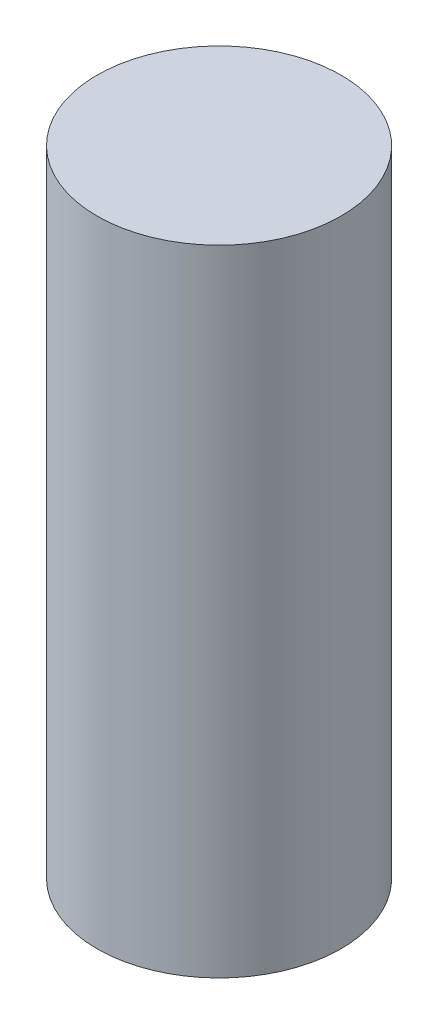
ISO-10303-21;
HEADER;
FILE_DESCRIPTION(('STEP AP214'),'2;1');
FILE_NAME('part.step','',(''),(''),'','','');
FILE_SCHEMA(('AUTOMOTIVE_DESIGN { 1 0 10303 214 1 1 1 1 }'));
ENDSEC;
DATA;
#1=APPLICATION_CONTEXT('core data for automotive mechanical design processes');
#2=APPLICATION_PROTOCOL_DEFINITION('international standard','automotive_design',2000,#1);
#3=PRODUCT_CONTEXT('',#1,'mechanical');
#4=PRODUCT('Part','Part','',(#3));
#5=PRODUCT_RELATED_PRODUCT_CATEGORY('part','',(#4));
#6=PRODUCT_DEFINITION_FORMATION('','',#4);
#7=PRODUCT_DEFINITION_CONTEXT('part definition',#1,'design');
#8=PRODUCT_DEFINITION('design','',#6,#7);
#9=PRODUCT_DEFINITION_SHAPE('','',#8);
#10=(LENGTH_UNIT() NAMED_UNIT(*) SI_UNIT(.MILLI.,.METRE.));
#11=(NAMED_UNIT(*) PLANE_ANGLE_UNIT() SI_UNIT($,.RADIAN.));
#12=(NAMED_UNIT(*) SI_UNIT($,.STERADIAN.) SOLID_ANGLE_UNIT());
#13=UNCERTAINTY_MEASURE_WITH_UNIT(LENGTH_MEASURE(1.E-05),#10,'distance_accuracy_value','');
#14=(GEOMETRIC_REPRESENTATION_CONTEXT(3) GLOBAL_UNCERTAINTY_ASSIGNED_CONTEXT((#13)) GLOBAL_UNIT_ASSIGNED_CONTEXT((#10,
#11,#12)) REPRESENTATION_CONTEXT('',''));
#15=CARTESIAN_POINT('',(0.,0.,0.));
#16=DIRECTION('',(0.,0.,1.));
#17=DIRECTION('',(1.,0.,0.));
#18=AXIS2_PLACEMENT_3D('',#15,#16,#17);
#19=CARTESIAN_POINT('',(0.,2.6,0.));
#20=DIRECTION('',(0.,-1.,0.));
#21=DIRECTION('',(0.,0.,-1.));
#22=AXIS2_PLACEMENT_3D('',#19,#20,#21);
#23=CYLINDRICAL_SURFACE('',#22,0.5);
#24=CARTESIAN_POINT('',(0.,2.6,0.));
#25=DIRECTION('',(0.,1.,0.));
#26=DIRECTION('',(0.,0.,1.));
#27=AXIS2_PLACEMENT_3D('',#24,#25,#26);
#28=CIRCLE('',#27,0.5);
#29=CARTESIAN_POINT('',(0.,2.6,0.5));
#30=VERTEX_POINT('',#29);
#31=EDGE_CURVE('E10',#30,#30,#28,.T.);
#32=ORIENTED_EDGE('',*,*,#31,.F.);
#33=EDGE_LOOP('',(#32));
#34=FACE_BOUND('',#33,.T.);
#35=CARTESIAN_POINT('',(0.,0.,0.));
#36=DIRECTION('',(0.,1.,0.));
#37=DIRECTION('',(0.,0.,1.));
#38=AXIS2_PLACEMENT_3D('',#35,#36,#37);
#39=CIRCLE('',#38,0.5);
#40=CARTESIAN_POINT('',(0.,0.,0.5));
#41=VERTEX_POINT('',#40);
#42=EDGE_CURVE('E33',#41,#41,#39,.T.);
#43=ORIENTED_EDGE('',*,*,#42,.T.);
#44=EDGE_LOOP('',(#43));
#45=FACE_BOUND('',#44,.T.);
#46=ADVANCED_FACE('F30',(#34,#45),#23,.T.);
#47=CARTESIAN_POINT('',(0.,2.6,0.));
#48=DIRECTION('',(0.,1.,0.));
#49=DIRECTION('',(0.,0.,1.));
#50=AXIS2_PLACEMENT_3D('',#47,#48,#49);
#51=PLANE('',#50);
#52=ORIENTED_EDGE('',*,*,#31,.T.);
#53=EDGE_LOOP('',(#52));
#54=FACE_BOUND('',#53,.T.);
#55=ADVANCED_FACE('F45',(#54),#51,.T.);
#56=CARTESIAN_POINT('',(0.,0.,0.));
#57=DIRECTION('',(0.,1.,0.));
#58=DIRECTION('',(0.,0.,1.));
#59=AXIS2_PLACEMENT_3D('',#56,#57,#58);
#60=PLANE('',#59);
#61=ORIENTED_EDGE('',*,*,#42,.F.);
#62=EDGE_LOOP('',(#61));
#63=FACE_BOUND('',#62,.T.);
#64=ADVANCED_FACE('F43',(#63),#60,.F.);
#65=CLOSED_SHELL('',(#46,#55,#64));
#66=MANIFOLD_SOLID_BREP('B2',#65);
#67=ADVANCED_BREP_SHAPE_REPRESENTATION('',(#18,#66),#14);
#68=SHAPE_DEFINITION_REPRESENTATION(#9,#67);
ENDSEC;
END-ISO-10303-21;
